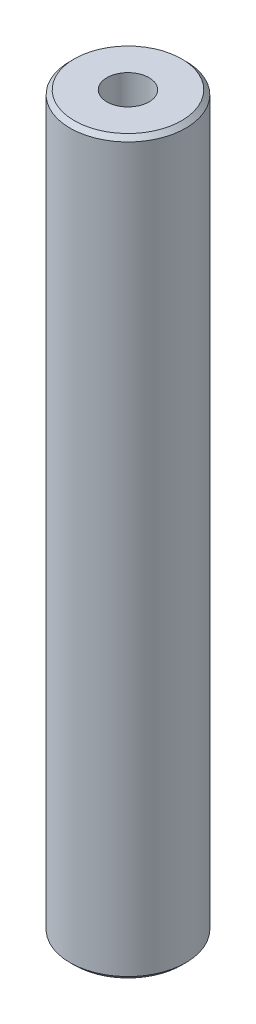
ISO-10303-21;
HEADER;
FILE_DESCRIPTION(('STEP AP214'),'2;1');
FILE_NAME('part.step','',(''),(''),'','','');
FILE_SCHEMA(('AUTOMOTIVE_DESIGN { 1 0 10303 214 1 1 1 1 }'));
ENDSEC;
DATA;
#1=APPLICATION_CONTEXT('core data for automotive mechanical design processes');
#2=APPLICATION_PROTOCOL_DEFINITION('international standard','automotive_design',2000,#1);
#3=PRODUCT_CONTEXT('',#1,'mechanical');
#4=PRODUCT('Part','Part','',(#3));
#5=PRODUCT_RELATED_PRODUCT_CATEGORY('part','',(#4));
#6=PRODUCT_DEFINITION_FORMATION('','',#4);
#7=PRODUCT_DEFINITION_CONTEXT('part definition',#1,'design');
#8=PRODUCT_DEFINITION('design','',#6,#7);
#9=PRODUCT_DEFINITION_SHAPE('','',#8);
#10=(LENGTH_UNIT() NAMED_UNIT(*) SI_UNIT(.MILLI.,.METRE.));
#11=(NAMED_UNIT(*) PLANE_ANGLE_UNIT() SI_UNIT($,.RADIAN.));
#12=(NAMED_UNIT(*) SI_UNIT($,.STERADIAN.) SOLID_ANGLE_UNIT());
#13=UNCERTAINTY_MEASURE_WITH_UNIT(LENGTH_MEASURE(1.E-05),#10,'distance_accuracy_value','');
#14=(GEOMETRIC_REPRESENTATION_CONTEXT(3) GLOBAL_UNCERTAINTY_ASSIGNED_CONTEXT((#13)) GLOBAL_UNIT_ASSIGNED_CONTEXT((#10,
#11,#12)) REPRESENTATION_CONTEXT('',''));
#15=CARTESIAN_POINT('',(0.,0.,0.));
#16=DIRECTION('',(0.,0.,1.));
#17=DIRECTION('',(1.,0.,0.));
#18=AXIS2_PLACEMENT_3D('',#15,#16,#17);
#19=CARTESIAN_POINT('',(0.,600.,0.));
#20=DIRECTION('',(0.,-1.,0.));
#21=DIRECTION('',(0.,0.,-1.));
#22=AXIS2_PLACEMENT_3D('',#19,#20,#21);
#23=CYLINDRICAL_SURFACE('',#22,47.5);
#24=CARTESIAN_POINT('',(0.,596.487950058713,0.));
#25=DIRECTION('',(0.,1.,0.));
#26=DIRECTION('',(0.,0.,1.));
#27=AXIS2_PLACEMENT_3D('',#24,#25,#26);
#28=CIRCLE('',#27,47.5);
#29=CARTESIAN_POINT('',(0.,596.487950058713,47.5));
#30=VERTEX_POINT('',#29);
#31=EDGE_CURVE('E50',#30,#30,#28,.F.);
#32=ORIENTED_EDGE('',*,*,#31,.T.);
#33=EDGE_LOOP('',(#32));
#34=FACE_BOUND('',#33,.T.);
#35=CARTESIAN_POINT('',(0.,3.51204994128684,0.));
#36=DIRECTION('',(0.,1.,0.));
#37=DIRECTION('',(0.,0.,1.));
#38=AXIS2_PLACEMENT_3D('',#35,#36,#37);
#39=CIRCLE('',#38,47.5);
#40=CARTESIAN_POINT('',(0.,3.51204994128684,47.5));
#41=VERTEX_POINT('',#40);
#42=EDGE_CURVE('E51',#41,#41,#39,.T.);
#43=ORIENTED_EDGE('',*,*,#42,.T.);
#44=EDGE_LOOP('',(#43));
#45=FACE_BOUND('',#44,.T.);
#46=ADVANCED_FACE('F39',(#34,#45),#23,.T.);
#47=CARTESIAN_POINT('',(0.,600.,0.));
#48=DIRECTION('',(0.,1.,0.));
#49=DIRECTION('',(0.,0.,1.));
#50=AXIS2_PLACEMENT_3D('',#47,#48,#49);
#51=PLANE('',#50);
#52=CARTESIAN_POINT('',(0.,600.,0.));
#53=DIRECTION('',(0.,1.,0.));
#54=DIRECTION('',(0.,0.,1.));
#55=AXIS2_PLACEMENT_3D('',#52,#53,#54);
#56=CIRCLE('',#55,43.9879500587134);
#57=CARTESIAN_POINT('',(0.,600.,43.9879500587134));
#58=VERTEX_POINT('',#57);
#59=EDGE_CURVE('E54',#58,#58,#56,.T.);
#60=ORIENTED_EDGE('',*,*,#59,.T.);
#61=EDGE_LOOP('',(#60));
#62=FACE_BOUND('',#61,.T.);
#63=CARTESIAN_POINT('',(0.,600.,0.));
#64=DIRECTION('',(0.,1.,0.));
#65=DIRECTION('',(0.,0.,1.));
#66=AXIS2_PLACEMENT_3D('',#63,#64,#65);
#67=CIRCLE('',#66,17.2621134701932);
#68=CARTESIAN_POINT('',(0.,600.,17.2621134701932));
#69=VERTEX_POINT('',#68);
#70=EDGE_CURVE('E58',#69,#69,#67,.T.);
#71=ORIENTED_EDGE('',*,*,#70,.F.);
#72=EDGE_LOOP('',(#71));
#73=FACE_BOUND('',#72,.T.);
#74=ADVANCED_FACE('F69',(#62,#73),#51,.T.);
#75=CARTESIAN_POINT('',(0.,0.,0.));
#76=DIRECTION('',(0.,1.,0.));
#77=DIRECTION('',(0.,0.,1.));
#78=AXIS2_PLACEMENT_3D('',#75,#76,#77);
#79=PLANE('',#78);
#80=CARTESIAN_POINT('',(0.,0.,0.));
#81=DIRECTION('',(0.,1.,0.));
#82=DIRECTION('',(0.,0.,1.));
#83=AXIS2_PLACEMENT_3D('',#80,#81,#82);
#84=CIRCLE('',#83,43.9879500587132);
#85=CARTESIAN_POINT('',(0.,0.,43.9879500587132));
#86=VERTEX_POINT('',#85);
#87=EDGE_CURVE('E10',#86,#86,#84,.F.);
#88=ORIENTED_EDGE('',*,*,#87,.T.);
#89=EDGE_LOOP('',(#88));
#90=FACE_BOUND('',#89,.T.);
#91=CARTESIAN_POINT('',(0.,0.,0.));
#92=DIRECTION('',(0.,1.,0.));
#93=DIRECTION('',(0.,0.,1.));
#94=AXIS2_PLACEMENT_3D('',#91,#92,#93);
#95=CIRCLE('',#94,17.2621134701932);
#96=CARTESIAN_POINT('',(0.,0.,17.2621134701932));
#97=VERTEX_POINT('',#96);
#98=EDGE_CURVE('E63',#97,#97,#95,.T.);
#99=ORIENTED_EDGE('',*,*,#98,.T.);
#100=EDGE_LOOP('',(#99));
#101=FACE_BOUND('',#100,.T.);
#102=ADVANCED_FACE('F75',(#90,#101),#79,.F.);
#103=CARTESIAN_POINT('',(0.,600.,0.));
#104=DIRECTION('',(0.,-1.,0.));
#105=DIRECTION('',(0.,0.,-1.));
#106=AXIS2_PLACEMENT_3D('',#103,#104,#105);
#107=CYLINDRICAL_SURFACE('',#106,17.2621134701932);
#108=ORIENTED_EDGE('',*,*,#70,.T.);
#109=EDGE_LOOP('',(#108));
#110=FACE_BOUND('',#109,.T.);
#111=ORIENTED_EDGE('',*,*,#98,.F.);
#112=EDGE_LOOP('',(#111));
#113=FACE_BOUND('',#112,.T.);
#114=ADVANCED_FACE('F70',(#110,#113),#107,.F.);
#115=CARTESIAN_POINT('',(0.,600.,0.));
#116=DIRECTION('',(0.,-1.,0.));
#117=DIRECTION('',(0.,0.,-1.));
#118=AXIS2_PLACEMENT_3D('',#115,#116,#117);
#119=CONICAL_SURFACE('',#118,43.9879500587134,0.785398163397444);
#120=ORIENTED_EDGE('',*,*,#31,.F.);
#121=EDGE_LOOP('',(#120));
#122=FACE_BOUND('',#121,.T.);
#123=ORIENTED_EDGE('',*,*,#59,.F.);
#124=EDGE_LOOP('',(#123));
#125=FACE_BOUND('',#124,.T.);
#126=ADVANCED_FACE('F81',(#122,#125),#119,.T.);
#127=CARTESIAN_POINT('',(0.,3.51204994128684,0.));
#128=DIRECTION('',(0.,1.,0.));
#129=DIRECTION('',(0.,0.,1.));
#130=AXIS2_PLACEMENT_3D('',#127,#128,#129);
#131=CONICAL_SURFACE('',#130,47.5,0.785398163397443);
#132=CARTESIAN_POINT('',(0.,0.,43.9879500587132));
#133=CARTESIAN_POINT('',(0.,0.0365838535550716,44.0245339122683));
#134=CARTESIAN_POINT('',(0.,0.0731677071101425,44.0611177658233));
#135=CARTESIAN_POINT('',(0.,0.146335414220284,44.1342854729335));
#136=CARTESIAN_POINT('',(0.,0.182919267775355,44.1708693264885));
#137=CARTESIAN_POINT('',(0.,0.256086974885498,44.2440370335987));
#138=CARTESIAN_POINT('',(0.,0.29267082844057,44.2806208871538));
#139=CARTESIAN_POINT('',(0.,0.365838535550713,44.3537885942639));
#140=CARTESIAN_POINT('',(0.,0.402422389105784,44.390372447819));
#141=CARTESIAN_POINT('',(0.,0.475590096215926,44.4635401549291));
#142=CARTESIAN_POINT('',(0.,0.512173949770998,44.5001240084842));
#143=CARTESIAN_POINT('',(0.,0.58534165688114,44.5732917155943));
#144=CARTESIAN_POINT('',(0.,0.621925510436211,44.6098755691494));
#145=CARTESIAN_POINT('',(0.,0.695093217546354,44.6830432762595));
#146=CARTESIAN_POINT('',(0.,0.731677071101425,44.7196271298146));
#147=CARTESIAN_POINT('',(0.,0.804844778211568,44.7927948369248));
#148=CARTESIAN_POINT('',(0.,0.841428631766638,44.8293786904798));
#149=CARTESIAN_POINT('',(0.,0.914596338876781,44.90254639759));
#150=CARTESIAN_POINT('',(0.,0.951180192431853,44.939130251145));
#151=CARTESIAN_POINT('',(0.,1.024347899542,45.0122979582552));
#152=CARTESIAN_POINT('',(0.,1.06093175309707,45.0488818118102));
#153=CARTESIAN_POINT('',(0.,1.13409946020721,45.1220495189204));
#154=CARTESIAN_POINT('',(0.,1.17068331376228,45.1586333724755));
#155=CARTESIAN_POINT('',(0.,1.24385102087242,45.2318010795856));
#156=CARTESIAN_POINT('',(0.,1.28043487442749,45.2683849331407));
#157=CARTESIAN_POINT('',(0.,1.35360258153764,45.3415526402508));
#158=CARTESIAN_POINT('',(0.,1.39018643509271,45.3781364938059));
#159=CARTESIAN_POINT('',(0.,1.46335414220285,45.451304200916));
#160=CARTESIAN_POINT('',(0.,1.49993799575792,45.4878880544711));
#161=CARTESIAN_POINT('',(0.,1.57310570286806,45.5610557615813));
#162=CARTESIAN_POINT('',(0.,1.60968955642314,45.5976396151363));
#163=CARTESIAN_POINT('',(0.,1.68285726353328,45.6708073222465));
#164=CARTESIAN_POINT('',(0.,1.71944111708835,45.7073911758015));
#165=CARTESIAN_POINT('',(0.,1.79260882419849,45.7805588829117));
#166=CARTESIAN_POINT('',(0.,1.82919267775356,45.8171427364667));
#167=CARTESIAN_POINT('',(0.,1.90236038486371,45.8903104435769));
#168=CARTESIAN_POINT('',(0.,1.93894423841878,45.926894297132));
#169=CARTESIAN_POINT('',(0.,2.01211194552892,46.0000620042421));
#170=CARTESIAN_POINT('',(0.,2.04869579908399,46.0366458577972));
#171=CARTESIAN_POINT('',(0.,2.12186350619413,46.1098135649073));
#172=CARTESIAN_POINT('',(0.,2.15844735974921,46.1463974184624));
#173=CARTESIAN_POINT('',(0.,2.23161506685935,46.2195651255725));
#174=CARTESIAN_POINT('',(0.,2.26819892041442,46.2561489791276));
#175=CARTESIAN_POINT('',(0.,2.34136662752456,46.3293166862377));
#176=CARTESIAN_POINT('',(0.,2.37795048107963,46.3659005397928));
#177=CARTESIAN_POINT('',(0.,2.45111818818978,46.4390682469029));
#178=CARTESIAN_POINT('',(0.,2.48770204174485,46.475652100458));
#179=CARTESIAN_POINT('',(0.,2.56086974885499,46.5488198075682));
#180=CARTESIAN_POINT('',(0.,2.59745360241006,46.5854036611232));
#181=CARTESIAN_POINT('',(0.,2.6706213095202,46.6585713682334));
#182=CARTESIAN_POINT('',(0.,2.70720516307527,46.6951552217884));
#183=CARTESIAN_POINT('',(0.,2.78037287018542,46.7683229288986));
#184=CARTESIAN_POINT('',(0.,2.81695672374049,46.8049067824537));
#185=CARTESIAN_POINT('',(0.,2.89012443085063,46.8780744895638));
#186=CARTESIAN_POINT('',(0.,2.9267082844057,46.9146583431189));
#187=CARTESIAN_POINT('',(0.,2.99987599151584,46.987826050229));
#188=CARTESIAN_POINT('',(0.,3.03645984507092,47.0244099037841));
#189=CARTESIAN_POINT('',(0.,3.10962755218106,47.0975776108942));
#190=CARTESIAN_POINT('',(0.,3.14621140573613,47.1341614644493));
#191=CARTESIAN_POINT('',(0.,3.21937911284627,47.2073291715594));
#192=CARTESIAN_POINT('',(0.,3.25596296640134,47.2439130251145));
#193=CARTESIAN_POINT('',(0.,3.32913067351149,47.3170807322247));
#194=CARTESIAN_POINT('',(0.,3.36571452706656,47.3536645857797));
#195=CARTESIAN_POINT('',(0.,3.4388822341767,47.4268322928899));
#196=CARTESIAN_POINT('',(0.,3.47546608773177,47.4634161464449));
#197=CARTESIAN_POINT('',(0.,3.51204994128684,47.5));
#198=B_SPLINE_CURVE_WITH_KNOTS('',3,(#132,#133,#134,#135,#136,#137,#138,#139,#140,#141,#142,
#143,#144,#145,#146,#147,#148,#149,#150,#151,#152,#153,#154,#155,#156,#157,#158,#159,#160,#161,
#162,#163,#164,#165,#166,#167,#168,#169,#170,#171,#172,#173,#174,#175,#176,#177,#178,#179,#180,
#181,#182,#183,#184,#185,#186,#187,#188,#189,#190,#191,#192,#193,#194,#195,#196,#197),
.UNSPECIFIED.,.F.,.F.,(4,2,2,2,2,2,2,2,2,2,2,2,2,2,2,2,2,2,2,2,2,2,2,2,2,2,2,2,2,2,2,2,4),(0.,
0.155212145584359,0.310424291168718,0.465636436753072,0.620848582337431,0.77606072792179,
0.931272873506149,1.08648501909051,1.24169716467487,1.39690931025922,1.55212145584358,
1.70733360142794,1.8625457470123,2.01775789259666,2.17297003818102,2.32818218376537,
2.48339432934973,2.63860647493409,2.79381862051845,2.9490307661028,3.10424291168716,
3.25945505727152,3.41466720285588,3.56987934844024,3.72509149402459,3.88030363960895,
4.03551578519331,4.19072793077767,4.34594007636203,4.50115222194638,4.65636436753074,
4.8115765131151,4.96678865869946),.UNSPECIFIED.);
#199=EDGE_CURVE('BSEAM45',#86,#41,#198,.T.);
#200=ORIENTED_EDGE('',*,*,#87,.F.);
#201=ORIENTED_EDGE('',*,*,#42,.F.);
#202=ORIENTED_EDGE('',*,*,#199,.T.);
#203=ORIENTED_EDGE('',*,*,#199,.F.);
#204=EDGE_LOOP('',(#200,#202,#201,#203));
#205=FACE_BOUND('',#204,.T.);
#206=ADVANCED_FACE('F45',(#205),#131,.T.);
#207=CLOSED_SHELL('',(#46,#74,#102,#114,#126,#206));
#208=MANIFOLD_SOLID_BREP('B2',#207);
#209=ADVANCED_BREP_SHAPE_REPRESENTATION('',(#18,#208),#14);
#210=SHAPE_DEFINITION_REPRESENTATION(#9,#209);
ENDSEC;
END-ISO-10303-21;
